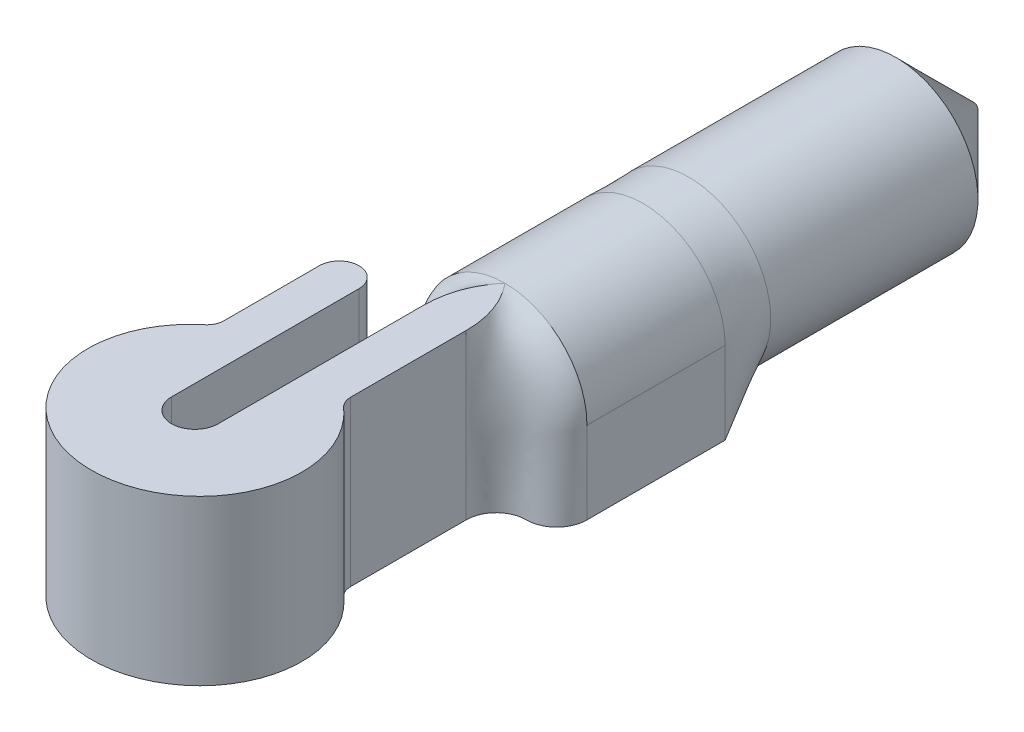
ISO-10303-21;
HEADER;
FILE_DESCRIPTION(('STEP AP214'),'2;1');
FILE_NAME('part.step','',(''),(''),'','','');
FILE_SCHEMA(('AUTOMOTIVE_DESIGN { 1 0 10303 214 1 1 1 1 }'));
ENDSEC;
DATA;
#1=APPLICATION_CONTEXT('core data for automotive mechanical design processes');
#2=APPLICATION_PROTOCOL_DEFINITION('international standard','automotive_design',2000,#1);
#3=PRODUCT_CONTEXT('',#1,'mechanical');
#4=PRODUCT('Part','Part','',(#3));
#5=PRODUCT_RELATED_PRODUCT_CATEGORY('part','',(#4));
#6=PRODUCT_DEFINITION_FORMATION('','',#4);
#7=PRODUCT_DEFINITION_CONTEXT('part definition',#1,'design');
#8=PRODUCT_DEFINITION('design','',#6,#7);
#9=PRODUCT_DEFINITION_SHAPE('','',#8);
#10=(LENGTH_UNIT() NAMED_UNIT(*) SI_UNIT(.MILLI.,.METRE.));
#11=(NAMED_UNIT(*) PLANE_ANGLE_UNIT() SI_UNIT($,.RADIAN.));
#12=(NAMED_UNIT(*) SI_UNIT($,.STERADIAN.) SOLID_ANGLE_UNIT());
#13=UNCERTAINTY_MEASURE_WITH_UNIT(LENGTH_MEASURE(1.E-05),#10,'distance_accuracy_value','');
#14=(GEOMETRIC_REPRESENTATION_CONTEXT(3) GLOBAL_UNCERTAINTY_ASSIGNED_CONTEXT((#13)) GLOBAL_UNIT_ASSIGNED_CONTEXT((#10,
#11,#12)) REPRESENTATION_CONTEXT('',''));
#15=CARTESIAN_POINT('',(0.,0.,0.));
#16=DIRECTION('',(0.,0.,1.));
#17=DIRECTION('',(1.,0.,0.));
#18=AXIS2_PLACEMENT_3D('',#15,#16,#17);
#19=CARTESIAN_POINT('',(1.3,2.375,-19.));
#20=DIRECTION('',(0.,0.,1.));
#21=DIRECTION('',(1.,0.,0.));
#22=AXIS2_PLACEMENT_3D('',#19,#20,#21);
#23=CYLINDRICAL_SURFACE('',#22,2.375);
#24=CARTESIAN_POINT('',(1.3,2.375,-19.));
#25=DIRECTION('',(0.,0.,-1.));
#26=DIRECTION('',(-1.,0.,0.));
#27=AXIS2_PLACEMENT_3D('',#24,#25,#26);
#28=CIRCLE('',#27,2.375);
#29=CARTESIAN_POINT('',(-1.075,2.375,-19.));
#30=VERTEX_POINT('',#29);
#31=EDGE_CURVE('E882',#30,#30,#28,.T.);
#32=ORIENTED_EDGE('',*,*,#31,.F.);
#33=EDGE_LOOP('',(#32));
#34=FACE_BOUND('',#33,.T.);
#35=CARTESIAN_POINT('',(-0.713995972012084,1.11625251749245,-13.));
#36=CARTESIAN_POINT('',(-0.60550803809779,0.942671823229577,-13.));
#37=CARTESIAN_POINT('',(-0.346326546498124,0.629631592535442,-13.));
#38=CARTESIAN_POINT('',(0.294663896422089,0.158196420254061,-13.));
#39=CARTESIAN_POINT('',(1.29986396853161,-0.106222952831294,-13.));
#40=CARTESIAN_POINT('',(2.30560098822545,0.158266036395828,-13.));
#41=CARTESIAN_POINT('',(2.94627731964234,0.629643292513034,-13.));
#42=CARTESIAN_POINT('',(3.20550803809779,0.942671823229577,-13.));
#43=CARTESIAN_POINT('',(3.31399597201208,1.11625251749245,-13.));
#44=B_SPLINE_CURVE_WITH_KNOTS('',3,(#35,#36,#37,#38,#39,#40,#41,#42,#43),.UNSPECIFIED.,.F.,.F.,
(4,1,1,1,1,1,4),(0.,0.125,0.25,0.5,0.75,0.875,1.),.UNSPECIFIED.);
#45=CARTESIAN_POINT('',(-0.714181385569733,1.11613697199891,-13.));
#46=VERTEX_POINT('',#45);
#47=CARTESIAN_POINT('',(3.31417166163639,1.11614325527003,-13.));
#48=VERTEX_POINT('',#47);
#49=EDGE_CURVE('E13',#46,#48,#44,.T.);
#50=ORIENTED_EDGE('',*,*,#49,.F.);
#51=CARTESIAN_POINT('',(1.3,2.375,-13.));
#52=DIRECTION('',(0.,0.,1.));
#53=DIRECTION('',(1.,0.,0.));
#54=AXIS2_PLACEMENT_3D('',#51,#52,#53);
#55=CIRCLE('',#54,2.375);
#56=EDGE_CURVE('E178',#48,#46,#55,.T.);
#57=ORIENTED_EDGE('',*,*,#56,.F.);
#58=EDGE_LOOP('',(#50,#57));
#59=FACE_BOUND('',#58,.T.);
#60=ADVANCED_FACE('F167',(#34,#59),#23,.T.);
#61=CARTESIAN_POINT('',(3.675,0.,-11.6780191334391));
#62=CARTESIAN_POINT('',(3.31399597201208,1.11625251749245,-13.));
#63=CARTESIAN_POINT('',(3.47708333333333,0.,-11.6780191334391));
#64=CARTESIAN_POINT('',(3.20550803809779,0.942671823229577,-13.));
#65=CARTESIAN_POINT('',(3.08125,0.,-11.6780191334392));
#66=CARTESIAN_POINT('',(2.94627731964234,0.629643292513034,-13.));
#67=CARTESIAN_POINT('',(2.28958333333334,0.,-11.6780191334392));
#68=CARTESIAN_POINT('',(2.30560098822545,0.158266036395828,-13.));
#69=CARTESIAN_POINT('',(1.3,0.,-11.6780191334391));
#70=CARTESIAN_POINT('',(1.29986396853161,-0.106222952831294,-13.));
#71=CARTESIAN_POINT('',(0.310416666666667,0.,-11.6780191334392));
#72=CARTESIAN_POINT('',(0.294663896422089,0.158196420254061,-13.));
#73=CARTESIAN_POINT('',(-0.48125,0.,-11.6780191334392));
#74=CARTESIAN_POINT('',(-0.346326546498124,0.629631592535442,-13.));
#75=CARTESIAN_POINT('',(-0.877083333333333,0.,-11.6780191334391));
#76=CARTESIAN_POINT('',(-0.60550803809779,0.942671823229577,-13.));
#77=CARTESIAN_POINT('',(-1.075,0.,-11.6780191334391));
#78=CARTESIAN_POINT('',(-0.713995972012084,1.11625251749245,-13.));
#79=B_SPLINE_SURFACE_WITH_KNOTS('',3,1,((#61,#62),(#63,#64),(#65,#66),(#67,#68),(#69,#70),(#71,
#72),(#73,#74),(#75,#76),(#77,#78)),.UNSPECIFIED.,.F.,.F.,.F.,(4,1,1,1,1,1,4),(2,2),(0.,0.125,
0.25,0.5,0.75,0.875,1.),(0.,1.),.UNSPECIFIED.);
#80=DIRECTION('',(1.,0.,0.));
#81=VECTOR('',#80,1.);
#82=CARTESIAN_POINT('',(3.675,0.,-11.6780191334391));
#83=LINE('',#82,#81);
#84=CARTESIAN_POINT('',(-1.075,0.,-11.6780191334391));
#85=VERTEX_POINT('',#84);
#86=CARTESIAN_POINT('',(3.675,0.,-11.6780191334391));
#87=VERTEX_POINT('',#86);
#88=EDGE_CURVE('E171',#85,#87,#83,.T.);
#89=DIRECTION('',(0.204248150970069,0.631551160202425,-0.74794774207312));
#90=VECTOR('',#89,1.);
#91=CARTESIAN_POINT('',(-0.894497986006042,0.558126258746224,-12.3390095667196));
#92=LINE('',#91,#90);
#93=EDGE_CURVE('E275',#85,#46,#92,.T.);
#94=DIRECTION('',(0.204248150970069,-0.631551160202425,0.74794774207312));
#95=VECTOR('',#94,1.);
#96=CARTESIAN_POINT('',(3.49449798600604,0.558126258746224,-12.3390095667196));
#97=LINE('',#96,#95);
#98=EDGE_CURVE('E286',#48,#87,#97,.T.);
#99=ORIENTED_EDGE('',*,*,#88,.F.);
#100=ORIENTED_EDGE('',*,*,#93,.T.);
#101=ORIENTED_EDGE('',*,*,#49,.T.);
#102=ORIENTED_EDGE('',*,*,#98,.T.);
#103=EDGE_LOOP('',(#99,#100,#101,#102));
#104=FACE_BOUND('',#103,.T.);
#105=ADVANCED_FACE('F292',(#104),#79,.T.);
#106=CARTESIAN_POINT('',(-1.075,0.,-11.6780191334391));
#107=CARTESIAN_POINT('',(-0.713995972012084,1.11625251749245,-13.));
#108=CARTESIAN_POINT('',(-1.075,0.197916666666667,-11.6780191334391));
#109=CARTESIAN_POINT('',(-0.810224067768728,1.27021747070308,-13.));
#110=CARTESIAN_POINT('',(-1.075,0.587757387922788,-11.6780191334391));
#111=CARTESIAN_POINT('',(-0.970298967263065,1.60581895112441,-13.));
#112=CARTESIAN_POINT('',(-1.075,1.16814642370217,-11.6780191334392));
#113=CARTESIAN_POINT('',(-1.0868390685559,2.15635912667143,-13.));
#114=CARTESIAN_POINT('',(-1.075,1.75674618093464,-11.6780191334391));
#115=CARTESIAN_POINT('',(-1.07216093712572,2.70834489752312,-13.));
#116=CARTESIAN_POINT('',(-1.075,2.16410786900154,-11.6780191334391));
#117=CARTESIAN_POINT('',(-0.983524387310852,3.04960459888077,-13.));
#118=CARTESIAN_POINT('',(-1.075,2.67939903841652,-11.6780191334391));
#119=CARTESIAN_POINT('',(-0.83755009514696,3.43886937798449,-13.));
#120=CARTESIAN_POINT('',(-0.956490562198617,3.29306959468298,-11.6780191334391));
#121=CARTESIAN_POINT('',(-0.594145096715219,3.86650032701684,-13.));
#122=CARTESIAN_POINT('',(-0.435168992337904,4.08662764047852,-11.6780191334392));
#123=CARTESIAN_POINT('',(-0.0626770280279037,4.36579823923451,-13.));
#124=CARTESIAN_POINT('',(0.357411512429113,4.62352484104911,-11.6780191334391));
#125=CARTESIAN_POINT('',(0.588687396920721,4.67761350696573,-13.));
#126=CARTESIAN_POINT('',(1.3,4.81338503000466,-11.6780191334392));
#127=CARTESIAN_POINT('',(1.3,4.78665047970972,-13.));
#128=CARTESIAN_POINT('',(2.24258848757089,4.6235248410491,-11.6780191334392));
#129=CARTESIAN_POINT('',(2.01131260307928,4.67761350696573,-13.));
#130=CARTESIAN_POINT('',(3.03516899233791,4.08662764047852,-11.6780191334391));
#131=CARTESIAN_POINT('',(2.6626770280279,4.36579823923452,-13.));
#132=CARTESIAN_POINT('',(3.55649056219862,3.29306959468298,-11.6780191334392));
#133=CARTESIAN_POINT('',(3.19414509671522,3.86650032701684,-13.));
#134=CARTESIAN_POINT('',(3.675,2.67939903841651,-11.6780191334391));
#135=CARTESIAN_POINT('',(3.43755009514696,3.43886937798449,-13.));
#136=CARTESIAN_POINT('',(3.675,2.16410786900154,-11.6780191334391));
#137=CARTESIAN_POINT('',(3.58352438731085,3.04960459888077,-13.));
#138=CARTESIAN_POINT('',(3.675,1.75674618093464,-11.6780191334392));
#139=CARTESIAN_POINT('',(3.67216093712571,2.70834489752312,-13.));
#140=CARTESIAN_POINT('',(3.675,1.16814642370217,-11.6780191334391));
#141=CARTESIAN_POINT('',(3.68683906855591,2.15635912667142,-13.));
#142=CARTESIAN_POINT('',(3.675,0.587757387922788,-11.6780191334392));
#143=CARTESIAN_POINT('',(3.57029896726306,1.60581895112441,-13.));
#144=CARTESIAN_POINT('',(3.675,0.197916666666667,-11.6780191334391));
#145=CARTESIAN_POINT('',(3.41022406776873,1.27021747070308,-13.));
#146=CARTESIAN_POINT('',(3.675,0.,-11.6780191334391));
#147=CARTESIAN_POINT('',(3.31399597201208,1.11625251749245,-13.));
#148=B_SPLINE_SURFACE_WITH_KNOTS('',3,1,((#106,#107),(#108,#109),(#110,#111),(#112,#113),(#114,
#115),(#116,#117),(#118,#119),(#120,#121),(#122,#123),(#124,#125),(#126,#127),(#128,#129),(#130,
#131),(#132,#133),(#134,#135),(#136,#137),(#138,#139),(#140,#141),(#142,#143),(#144,#145),(#146,
#147)),.UNSPECIFIED.,.F.,.F.,.F.,(4,1,1,1,2,1,1,1,1,1,1,1,2,1,1,1,4),(2,2),(0.,
0.0511584863378663,0.102316972675733,0.153475459013599,0.204633945351465,0.278475459013599,
0.352316972675733,0.426158486337866,0.5,0.573841513662134,0.647683027324267,0.721524540986401,
0.795366054648535,0.846524540986401,0.897683027324267,0.948841513662134,1.),(0.,1.),.UNSPECIFIED.);
#149=DIRECTION('',(0.,-1.,0.));
#150=VECTOR('',#149,1.);
#151=CARTESIAN_POINT('',(-1.075,0.,-11.6780191334391));
#152=LINE('',#151,#150);
#153=CARTESIAN_POINT('',(-1.075,2.375,-11.6780191334391));
#154=VERTEX_POINT('',#153);
#155=EDGE_CURVE('E279',#154,#85,#152,.T.);
#156=CARTESIAN_POINT('',(1.3,2.375,-11.6780191334391));
#157=DIRECTION('',(0.,0.,1.));
#158=DIRECTION('',(-1.,0.,0.));
#159=AXIS2_PLACEMENT_3D('',#156,#157,#158);
#160=CIRCLE('',#159,2.375);
#161=CARTESIAN_POINT('',(3.675,2.37500000000142,-11.6780191334392));
#162=VERTEX_POINT('',#161);
#163=EDGE_CURVE('E320',#162,#154,#160,.T.);
#164=DIRECTION('',(0.,1.,0.));
#165=VECTOR('',#164,1.);
#166=CARTESIAN_POINT('',(3.675,0.,-11.6780191334391));
#167=LINE('',#166,#165);
#168=EDGE_CURVE('E297',#87,#162,#167,.T.);
#169=ORIENTED_EDGE('',*,*,#155,.F.);
#170=ORIENTED_EDGE('',*,*,#163,.F.);
#171=ORIENTED_EDGE('',*,*,#168,.F.);
#172=ORIENTED_EDGE('',*,*,#98,.F.);
#173=ORIENTED_EDGE('',*,*,#56,.T.);
#174=ORIENTED_EDGE('',*,*,#93,.F.);
#175=EDGE_LOOP('',(#169,#170,#171,#172,#173,#174));
#176=FACE_BOUND('',#175,.T.);
#177=ADVANCED_FACE('F277',(#176),#148,.T.);
#178=CARTESIAN_POINT('',(-1.25,4.75,-5.42801913343913));
#179=DIRECTION('',(0.,-1.,0.));
#180=DIRECTION('',(0.,0.,-1.));
#181=AXIS2_PLACEMENT_3D('',#178,#179,#180);
#182=CYLINDRICAL_SURFACE('',#181,0.575);
#183=CARTESIAN_POINT('',(-1.25,0.,-5.42801913343913));
#184=DIRECTION('',(0.,1.,0.));
#185=DIRECTION('',(0.,0.,1.));
#186=AXIS2_PLACEMENT_3D('',#183,#184,#185);
#187=CIRCLE('',#186,0.575);
#188=CARTESIAN_POINT('',(-0.675,0.,-5.42801913343913));
#189=VERTEX_POINT('',#188);
#190=CARTESIAN_POINT('',(-1.825,0.,-5.42801913343913));
#191=VERTEX_POINT('',#190);
#192=EDGE_CURVE('E361',#189,#191,#187,.T.);
#193=ORIENTED_EDGE('',*,*,#192,.T.);
#194=DIRECTION('',(0.,-1.,0.));
#195=VECTOR('',#194,1.);
#196=CARTESIAN_POINT('',(-1.825,4.75,-5.42801913343913));
#197=LINE('',#196,#195);
#198=CARTESIAN_POINT('',(-1.825,4.75,-5.42801913343913));
#199=VERTEX_POINT('',#198);
#200=EDGE_CURVE('E727',#199,#191,#197,.T.);
#201=ORIENTED_EDGE('',*,*,#200,.F.);
#202=CARTESIAN_POINT('',(-1.25,4.75,-5.42801913343913));
#203=DIRECTION('',(0.,1.,0.));
#204=DIRECTION('',(0.,0.,1.));
#205=AXIS2_PLACEMENT_3D('',#202,#203,#204);
#206=CIRCLE('',#205,0.575);
#207=CARTESIAN_POINT('',(-0.675,4.75,-5.42801913343913));
#208=VERTEX_POINT('',#207);
#209=EDGE_CURVE('E759',#208,#199,#206,.T.);
#210=ORIENTED_EDGE('',*,*,#209,.F.);
#211=DIRECTION('',(0.,-1.,0.));
#212=VECTOR('',#211,1.);
#213=CARTESIAN_POINT('',(-0.675,4.75,-5.42801913343913));
#214=LINE('',#213,#212);
#215=EDGE_CURVE('E298',#208,#189,#214,.T.);
#216=ORIENTED_EDGE('',*,*,#215,.T.);
#217=EDGE_LOOP('',(#193,#201,#210,#216));
#218=FACE_BOUND('',#217,.T.);
#219=ADVANCED_FACE('F541',(#218),#182,.T.);
#220=CARTESIAN_POINT('',(-1.825,4.75,-5.42801913343913));
#221=DIRECTION('',(1.,0.,0.));
#222=DIRECTION('',(0.,0.,-1.));
#223=AXIS2_PLACEMENT_3D('',#220,#221,#222);
#224=PLANE('',#223);
#225=DIRECTION('',(0.,0.,1.));
#226=VECTOR('',#225,1.);
#227=CARTESIAN_POINT('',(-1.825,0.,-5.42801913343913));
#228=LINE('',#227,#226);
#229=CARTESIAN_POINT('',(-1.825,0.,-2.67224685078573));
#230=VERTEX_POINT('',#229);
#231=EDGE_CURVE('E687',#191,#230,#228,.T.);
#232=ORIENTED_EDGE('',*,*,#231,.T.);
#233=DIRECTION('',(0.,-1.,0.));
#234=VECTOR('',#233,1.);
#235=CARTESIAN_POINT('',(-1.825,4.75,-2.67224685078573));
#236=LINE('',#235,#234);
#237=CARTESIAN_POINT('',(-1.825,4.75,-2.67224685078573));
#238=VERTEX_POINT('',#237);
#239=EDGE_CURVE('E723',#238,#230,#236,.T.);
#240=ORIENTED_EDGE('',*,*,#239,.F.);
#241=DIRECTION('',(0.,0.,1.));
#242=VECTOR('',#241,1.);
#243=CARTESIAN_POINT('',(-1.825,4.75,-5.42801913343913));
#244=LINE('',#243,#242);
#245=EDGE_CURVE('E753',#199,#238,#244,.T.);
#246=ORIENTED_EDGE('',*,*,#245,.F.);
#247=ORIENTED_EDGE('',*,*,#200,.T.);
#248=EDGE_LOOP('',(#232,#240,#246,#247));
#249=FACE_BOUND('',#248,.T.);
#250=ADVANCED_FACE('F752',(#249),#224,.F.);
#251=CARTESIAN_POINT('',(-2.325,4.75,-2.67224685078573));
#252=DIRECTION('',(0.,-1.,0.));
#253=DIRECTION('',(0.,0.,-1.));
#254=AXIS2_PLACEMENT_3D('',#251,#252,#253);
#255=CYLINDRICAL_SURFACE('',#254,0.5);
#256=CARTESIAN_POINT('',(-2.325,0.,-2.67224685078573));
#257=DIRECTION('',(0.,-1.,0.));
#258=DIRECTION('',(0.,0.,1.));
#259=AXIS2_PLACEMENT_3D('',#256,#257,#258);
#260=CIRCLE('',#259,0.5);
#261=CARTESIAN_POINT('',(-2.00741301696706,0.,-2.28606229877977));
#262=VERTEX_POINT('',#261);
#263=EDGE_CURVE('E690',#230,#262,#260,.T.);
#264=ORIENTED_EDGE('',*,*,#263,.T.);
#265=DIRECTION('',(0.,-1.,0.));
#266=VECTOR('',#265,1.);
#267=CARTESIAN_POINT('',(-2.00741301696706,4.75,-2.28606229877977));
#268=LINE('',#267,#266);
#269=CARTESIAN_POINT('',(-2.00741301696706,4.75,-2.28606229877977));
#270=VERTEX_POINT('',#269);
#271=EDGE_CURVE('E719',#270,#262,#268,.T.);
#272=ORIENTED_EDGE('',*,*,#271,.F.);
#273=CARTESIAN_POINT('',(-2.325,4.75,-2.67224685078573));
#274=DIRECTION('',(0.,-1.,0.));
#275=DIRECTION('',(0.,0.,1.));
#276=AXIS2_PLACEMENT_3D('',#273,#274,#275);
#277=CIRCLE('',#276,0.5);
#278=EDGE_CURVE('E678',#238,#270,#277,.T.);
#279=ORIENTED_EDGE('',*,*,#278,.F.);
#280=ORIENTED_EDGE('',*,*,#239,.T.);
#281=EDGE_LOOP('',(#264,#272,#279,#280));
#282=FACE_BOUND('',#281,.T.);
#283=ADVANCED_FACE('F672',(#282),#255,.F.);
#284=CARTESIAN_POINT('',(0.,4.75,0.));
#285=DIRECTION('',(0.,1.,0.));
#286=DIRECTION('',(1.,0.,0.));
#287=AXIS2_PLACEMENT_3D('',#284,#285,#286);
#288=ELLIPSE('',#287,3.1,3.);
#289=DIRECTION('',(0.,-1.,0.));
#290=VECTOR('',#289,1.);
#291=SURFACE_OF_LINEAR_EXTRUSION('',#288,#290);
#292=CARTESIAN_POINT('',(0.,0.,0.));
#293=DIRECTION('',(0.,1.,0.));
#294=DIRECTION('',(1.,0.,0.));
#295=AXIS2_PLACEMENT_3D('',#292,#293,#294);
#296=ELLIPSE('',#295,3.1,3.);
#297=CARTESIAN_POINT('',(2.0934105931897,0.,-2.21264666985684));
#298=VERTEX_POINT('',#297);
#299=EDGE_CURVE('E693',#262,#298,#296,.T.);
#300=ORIENTED_EDGE('',*,*,#299,.T.);
#301=DIRECTION('',(0.,-1.,0.));
#302=VECTOR('',#301,1.);
#303=CARTESIAN_POINT('',(2.0934105931897,4.75,-2.21264666985684));
#304=LINE('',#303,#302);
#305=CARTESIAN_POINT('',(2.0934105931897,4.75,-2.21264666985684));
#306=VERTEX_POINT('',#305);
#307=EDGE_CURVE('E715',#306,#298,#304,.T.);
#308=ORIENTED_EDGE('',*,*,#307,.F.);
#309=EDGE_CURVE('E635',#270,#306,#288,.T.);
#310=ORIENTED_EDGE('',*,*,#309,.F.);
#311=ORIENTED_EDGE('',*,*,#271,.T.);
#312=EDGE_LOOP('',(#300,#308,#310,#311));
#313=FACE_BOUND('',#312,.T.);
#314=ADVANCED_FACE('F667',(#313),#291,.F.);
#315=CARTESIAN_POINT('',(2.425,4.75,-2.58687716739972));
#316=DIRECTION('',(0.,-1.,0.));
#317=DIRECTION('',(0.,0.,-1.));
#318=AXIS2_PLACEMENT_3D('',#315,#316,#317);
#319=CYLINDRICAL_SURFACE('',#318,0.5);
#320=CARTESIAN_POINT('',(2.425,0.,-2.58687716739972));
#321=DIRECTION('',(0.,-1.,0.));
#322=DIRECTION('',(0.,0.,-1.));
#323=AXIS2_PLACEMENT_3D('',#320,#321,#322);
#324=CIRCLE('',#323,0.5);
#325=CARTESIAN_POINT('',(1.925,0.,-2.58687716739972));
#326=VERTEX_POINT('',#325);
#327=EDGE_CURVE('E696',#298,#326,#324,.T.);
#328=ORIENTED_EDGE('',*,*,#327,.T.);
#329=DIRECTION('',(0.,-1.,0.));
#330=VECTOR('',#329,1.);
#331=CARTESIAN_POINT('',(1.925,4.75,-2.58687716739972));
#332=LINE('',#331,#330);
#333=CARTESIAN_POINT('',(1.925,4.75,-2.58687716739972));
#334=VERTEX_POINT('',#333);
#335=EDGE_CURVE('E455',#334,#326,#332,.T.);
#336=ORIENTED_EDGE('',*,*,#335,.F.);
#337=CARTESIAN_POINT('',(2.425,4.75,-2.58687716739972));
#338=DIRECTION('',(0.,-1.,0.));
#339=DIRECTION('',(0.,0.,-1.));
#340=AXIS2_PLACEMENT_3D('',#337,#338,#339);
#341=CIRCLE('',#340,0.5);
#342=EDGE_CURVE('E625',#306,#334,#341,.T.);
#343=ORIENTED_EDGE('',*,*,#342,.F.);
#344=ORIENTED_EDGE('',*,*,#307,.T.);
#345=EDGE_LOOP('',(#328,#336,#343,#344));
#346=FACE_BOUND('',#345,.T.);
#347=ADVANCED_FACE('F664',(#346),#319,.F.);
#348=CARTESIAN_POINT('',(1.925,4.75,-5.92801913343913));
#349=DIRECTION('',(-1.,0.,0.));
#350=DIRECTION('',(0.,0.,1.));
#351=AXIS2_PLACEMENT_3D('',#348,#349,#350);
#352=PLANE('',#351);
#353=DIRECTION('',(0.,0.,-1.));
#354=VECTOR('',#353,1.);
#355=CARTESIAN_POINT('',(1.925,0.,-5.92801913343913));
#356=LINE('',#355,#354);
#357=CARTESIAN_POINT('',(1.925,0.,-5.92801913343913));
#358=VERTEX_POINT('',#357);
#359=EDGE_CURVE('E460',#326,#358,#356,.T.);
#360=ORIENTED_EDGE('',*,*,#359,.T.);
#361=CARTESIAN_POINT('',(1.925,4.75,-5.92801913343913));
#362=CARTESIAN_POINT('',(1.925,4.51336985224696,-5.92801913343913));
#363=CARTESIAN_POINT('',(1.925,4.04745612850482,-5.92801913343914));
#364=CARTESIAN_POINT('',(1.925,3.3587572106361,-5.92801913343912));
#365=CARTESIAN_POINT('',(1.925,2.67005829276738,-5.92801913343913));
#366=CARTESIAN_POINT('',(1.925,2.20414456902524,-5.92801913343913));
#367=CARTESIAN_POINT('',(1.925,1.80831123569191,-5.92801913343913));
#368=CARTESIAN_POINT('',(1.925,1.48308616906621,-5.92801913343913));
#369=CARTESIAN_POINT('',(1.925,0.9837572106361,-5.92801913343913));
#370=CARTESIAN_POINT('',(1.925,0.48442825220599,-5.92801913343913));
#371=CARTESIAN_POINT('',(1.925,0.159203185580293,-5.92801913343913));
#372=CARTESIAN_POINT('',(1.925,0.,-5.92801913343913));
#373=B_SPLINE_CURVE_WITH_KNOTS('',3,(#361,#362,#363,#364,#365,#366,#367,#368,#369,#370,#371,
#372),.UNSPECIFIED.,.F.,.F.,(4,1,1,1,2,1,1,1,4),(0.,0.149450619633499,0.298901239266998,
0.448351858900497,0.597802478533996,0.698351858900497,0.798901239266998,0.899450619633499,1.),.UNSPECIFIED.);
#374=CARTESIAN_POINT('',(1.925,4.75,-5.92801913343913));
#375=VERTEX_POINT('',#374);
#376=EDGE_CURVE('E447',#375,#358,#373,.T.);
#377=ORIENTED_EDGE('',*,*,#376,.F.);
#378=DIRECTION('',(0.,0.,-1.));
#379=VECTOR('',#378,1.);
#380=CARTESIAN_POINT('',(1.925,4.75,-5.92801913343913));
#381=LINE('',#380,#379);
#382=EDGE_CURVE('E623',#334,#375,#381,.T.);
#383=ORIENTED_EDGE('',*,*,#382,.F.);
#384=ORIENTED_EDGE('',*,*,#335,.T.);
#385=EDGE_LOOP('',(#360,#377,#383,#384));
#386=FACE_BOUND('',#385,.T.);
#387=ADVANCED_FACE('F660',(#386),#352,.F.);
#388=CARTESIAN_POINT('',(0.674999999999999,4.75,-2.92801913343913));
#389=DIRECTION('',(1.,0.,0.));
#390=DIRECTION('',(0.,0.,-1.));
#391=AXIS2_PLACEMENT_3D('',#388,#389,#390);
#392=PLANE('',#391);
#393=DIRECTION('',(0.,0.,1.));
#394=VECTOR('',#393,1.);
#395=CARTESIAN_POINT('',(0.674999999999999,0.,-2.92801913343913));
#396=LINE('',#395,#394);
#397=CARTESIAN_POINT('',(0.674999999999999,0.,-5.92801913343913));
#398=VERTEX_POINT('',#397);
#399=CARTESIAN_POINT('',(0.675,0.,0.));
#400=VERTEX_POINT('',#399);
#401=EDGE_CURVE('E703',#398,#400,#396,.T.);
#402=ORIENTED_EDGE('',*,*,#401,.T.);
#403=DIRECTION('',(0.,-1.,0.));
#404=VECTOR('',#403,1.);
#405=CARTESIAN_POINT('',(0.675,4.75,0.));
#406=LINE('',#405,#404);
#407=CARTESIAN_POINT('',(0.675,4.75,0.));
#408=VERTEX_POINT('',#407);
#409=EDGE_CURVE('E709',#408,#400,#406,.T.);
#410=ORIENTED_EDGE('',*,*,#409,.F.);
#411=DIRECTION('',(0.,0.,1.));
#412=VECTOR('',#411,1.);
#413=CARTESIAN_POINT('',(0.674999999999999,4.75,-2.92801913343913));
#414=LINE('',#413,#412);
#415=CARTESIAN_POINT('',(0.674999999999999,4.75,-5.92801913343913));
#416=VERTEX_POINT('',#415);
#417=EDGE_CURVE('E629',#416,#408,#414,.T.);
#418=ORIENTED_EDGE('',*,*,#417,.F.);
#419=CARTESIAN_POINT('',(0.674999999999999,0.,-5.92801913343913));
#420=CARTESIAN_POINT('',(0.674999999999999,0.159203185580293,-5.92801913343913));
#421=CARTESIAN_POINT('',(0.675,0.484428252205989,-5.92801913343914));
#422=CARTESIAN_POINT('',(0.674999999999999,0.983757210636102,-5.92801913343912));
#423=CARTESIAN_POINT('',(0.674999999999999,1.48308616906621,-5.92801913343914));
#424=CARTESIAN_POINT('',(0.674999999999999,1.80831123569191,-5.92801913343913));
#425=CARTESIAN_POINT('',(0.674999999999999,2.20414456902524,-5.92801913343913));
#426=CARTESIAN_POINT('',(0.675,2.67005829276738,-5.92801913343913));
#427=CARTESIAN_POINT('',(0.674999999999998,3.3587572106361,-5.92801913343913));
#428=CARTESIAN_POINT('',(0.675,4.04745612850482,-5.92801913343913));
#429=CARTESIAN_POINT('',(0.674999999999999,4.51336985224696,-5.92801913343913));
#430=CARTESIAN_POINT('',(0.674999999999999,4.75,-5.92801913343913));
#431=B_SPLINE_CURVE_WITH_KNOTS('',3,(#419,#420,#421,#422,#423,#424,#425,#426,#427,#428,#429,
#430),.UNSPECIFIED.,.F.,.F.,(4,1,1,1,2,1,1,1,4),(0.,0.100549380366501,0.201098760733002,
0.301648141099503,0.402197521466004,0.551648141099503,0.701098760733002,0.850549380366501,1.),.UNSPECIFIED.);
#432=EDGE_CURVE('E456',#416,#398,#431,.F.);
#433=ORIENTED_EDGE('',*,*,#432,.T.);
#434=EDGE_LOOP('',(#402,#410,#418,#433));
#435=FACE_BOUND('',#434,.T.);
#436=ADVANCED_FACE('F651',(#435),#392,.F.);
#437=CARTESIAN_POINT('',(0.,4.75,0.));
#438=DIRECTION('',(0.,-1.,0.));
#439=DIRECTION('',(0.,0.,-1.));
#440=AXIS2_PLACEMENT_3D('',#437,#438,#439);
#441=CYLINDRICAL_SURFACE('',#440,0.675);
#442=CARTESIAN_POINT('',(0.,0.,0.));
#443=DIRECTION('',(0.,-1.,0.));
#444=DIRECTION('',(0.,0.,1.));
#445=AXIS2_PLACEMENT_3D('',#442,#443,#444);
#446=CIRCLE('',#445,0.675);
#447=CARTESIAN_POINT('',(-0.675,0.,0.));
#448=VERTEX_POINT('',#447);
#449=EDGE_CURVE('E699',#400,#448,#446,.T.);
#450=ORIENTED_EDGE('',*,*,#449,.T.);
#451=DIRECTION('',(0.,-1.,0.));
#452=VECTOR('',#451,1.);
#453=CARTESIAN_POINT('',(-0.675,4.75,0.));
#454=LINE('',#453,#452);
#455=CARTESIAN_POINT('',(-0.675,4.75,0.));
#456=VERTEX_POINT('',#455);
#457=EDGE_CURVE('E684',#456,#448,#454,.T.);
#458=ORIENTED_EDGE('',*,*,#457,.F.);
#459=CARTESIAN_POINT('',(0.,4.75,0.));
#460=DIRECTION('',(0.,-1.,0.));
#461=DIRECTION('',(0.,0.,1.));
#462=AXIS2_PLACEMENT_3D('',#459,#460,#461);
#463=CIRCLE('',#462,0.675);
#464=EDGE_CURVE('E633',#408,#456,#463,.T.);
#465=ORIENTED_EDGE('',*,*,#464,.F.);
#466=ORIENTED_EDGE('',*,*,#409,.T.);
#467=EDGE_LOOP('',(#450,#458,#465,#466));
#468=FACE_BOUND('',#467,.T.);
#469=ADVANCED_FACE('F659',(#468),#441,.F.);
#470=CARTESIAN_POINT('',(-0.675,4.75,-2.92801913343913));
#471=DIRECTION('',(-1.,0.,0.));
#472=DIRECTION('',(0.,0.,1.));
#473=AXIS2_PLACEMENT_3D('',#470,#471,#472);
#474=PLANE('',#473);
#475=DIRECTION('',(0.,0.,-1.));
#476=VECTOR('',#475,1.);
#477=CARTESIAN_POINT('',(-0.675,0.,-2.92801913343913));
#478=LINE('',#477,#476);
#479=EDGE_CURVE('E702',#448,#189,#478,.T.);
#480=ORIENTED_EDGE('',*,*,#479,.T.);
#481=ORIENTED_EDGE('',*,*,#215,.F.);
#482=DIRECTION('',(0.,0.,-1.));
#483=VECTOR('',#482,1.);
#484=CARTESIAN_POINT('',(-0.675,4.75,-2.92801913343913));
#485=LINE('',#484,#483);
#486=EDGE_CURVE('E372',#456,#208,#485,.T.);
#487=ORIENTED_EDGE('',*,*,#486,.F.);
#488=ORIENTED_EDGE('',*,*,#457,.T.);
#489=EDGE_LOOP('',(#480,#481,#487,#488));
#490=FACE_BOUND('',#489,.T.);
#491=ADVANCED_FACE('F484',(#490),#474,.F.);
#492=CARTESIAN_POINT('',(0.,4.75,0.));
#493=DIRECTION('',(0.,1.,0.));
#494=DIRECTION('',(0.,0.,1.));
#495=AXIS2_PLACEMENT_3D('',#492,#493,#494);
#496=PLANE('',#495);
#497=ORIENTED_EDGE('',*,*,#486,.T.);
#498=ORIENTED_EDGE('',*,*,#209,.T.);
#499=ORIENTED_EDGE('',*,*,#245,.T.);
#500=ORIENTED_EDGE('',*,*,#278,.T.);
#501=ORIENTED_EDGE('',*,*,#309,.T.);
#502=ORIENTED_EDGE('',*,*,#342,.T.);
#503=ORIENTED_EDGE('',*,*,#382,.T.);
#504=CARTESIAN_POINT('',(1.925,4.75,-5.92801913343913));
#505=CARTESIAN_POINT('',(1.925,4.75,-6.26135246677246));
#506=CARTESIAN_POINT('',(1.87291666666667,4.75,-6.57385246677247));
#507=CARTESIAN_POINT('',(1.66458333333333,4.75,-7.15718580010579));
#508=CARTESIAN_POINT('',(1.50833333333333,4.75,-7.42801913343914));
#509=CARTESIAN_POINT('',(1.3,4.75,-7.67801913343915));
#510=B_SPLINE_CURVE_WITH_KNOTS('',3,(#504,#505,#506,#507,#508,#509),.UNSPECIFIED.,.F.,.F.,(4,2,
4),(0.,0.499999999999998,1.),.UNSPECIFIED.);
#511=CARTESIAN_POINT('',(1.3,4.75,-7.67801913343915));
#512=VERTEX_POINT('',#511);
#513=EDGE_CURVE('E380',#375,#512,#510,.T.);
#514=ORIENTED_EDGE('',*,*,#513,.T.);
#515=CARTESIAN_POINT('',(0.674999999999999,4.75,-5.92801913343913));
#516=CARTESIAN_POINT('',(0.674999999999999,4.75,-6.26135246677246));
#517=CARTESIAN_POINT('',(0.727083333333331,4.75,-6.57385246677247));
#518=CARTESIAN_POINT('',(0.935416666666666,4.75,-7.15718580010579));
#519=CARTESIAN_POINT('',(1.09166666666667,4.75,-7.42801913343914));
#520=CARTESIAN_POINT('',(1.3,4.75,-7.67801913343915));
#521=B_SPLINE_CURVE_WITH_KNOTS('',3,(#515,#516,#517,#518,#519,#520),.UNSPECIFIED.,.F.,.F.,(4,2,
4),(0.,0.499999999999998,1.),.UNSPECIFIED.);
#522=EDGE_CURVE('E409',#416,#512,#521,.T.);
#523=ORIENTED_EDGE('',*,*,#522,.F.);
#524=ORIENTED_EDGE('',*,*,#417,.T.);
#525=ORIENTED_EDGE('',*,*,#464,.T.);
#526=EDGE_LOOP('',(#497,#498,#499,#500,#501,#502,#503,#514,#523,#524,#525));
#527=FACE_BOUND('',#526,.T.);
#528=ADVANCED_FACE('F482',(#527),#496,.T.);
#529=CARTESIAN_POINT('',(0.,0.,0.));
#530=DIRECTION('',(0.,1.,0.));
#531=DIRECTION('',(0.,0.,1.));
#532=AXIS2_PLACEMENT_3D('',#529,#530,#531);
#533=PLANE('',#532);
#534=ORIENTED_EDGE('',*,*,#192,.F.);
#535=ORIENTED_EDGE('',*,*,#479,.F.);
#536=ORIENTED_EDGE('',*,*,#449,.F.);
#537=ORIENTED_EDGE('',*,*,#401,.F.);
#538=CARTESIAN_POINT('',(0.674999999999999,0.,-5.92801913343913));
#539=CARTESIAN_POINT('',(0.675000000000002,0.,-6.41094476712185));
#540=CARTESIAN_POINT('',(0.282925633682723,0.,-6.80301913343913));
#541=CARTESIAN_POINT('',(-0.682925633682717,0.,-6.80301913343915));
#542=CARTESIAN_POINT('',(-1.07499999999999,0.,-7.19509349975643));
#543=CARTESIAN_POINT('',(-1.075,0.,-7.67801913343915));
#544=B_SPLINE_CURVE_WITH_KNOTS('',3,(#538,#539,#540,#541,#542,#543),.UNSPECIFIED.,.F.,.F.,(4,2,
4),(0.,0.499999999999998,1.),.UNSPECIFIED.);
#545=CARTESIAN_POINT('',(-1.075,0.,-7.67801913343915));
#546=VERTEX_POINT('',#545);
#547=EDGE_CURVE('E307',#398,#546,#544,.T.);
#548=ORIENTED_EDGE('',*,*,#547,.T.);
#549=DIRECTION('',(0.,0.,1.));
#550=VECTOR('',#549,1.);
#551=CARTESIAN_POINT('',(-1.075,0.,-11.6780191334391));
#552=LINE('',#551,#550);
#553=EDGE_CURVE('E302',#85,#546,#552,.T.);
#554=ORIENTED_EDGE('',*,*,#553,.F.);
#555=ORIENTED_EDGE('',*,*,#88,.T.);
#556=DIRECTION('',(0.,0.,1.));
#557=VECTOR('',#556,1.);
#558=CARTESIAN_POINT('',(3.675,0.,-11.6780191334391));
#559=LINE('',#558,#557);
#560=CARTESIAN_POINT('',(3.675,0.,-7.67801913343915));
#561=VERTEX_POINT('',#560);
#562=EDGE_CURVE('E461',#87,#561,#559,.T.);
#563=ORIENTED_EDGE('',*,*,#562,.T.);
#564=CARTESIAN_POINT('',(1.925,0.,-5.92801913343913));
#565=CARTESIAN_POINT('',(1.925,0.,-6.41094476712185));
#566=CARTESIAN_POINT('',(2.31707436631728,0.,-6.80301913343913));
#567=CARTESIAN_POINT('',(3.28292563368271,0.,-6.80301913343915));
#568=CARTESIAN_POINT('',(3.675,0.,-7.19509349975643));
#569=CARTESIAN_POINT('',(3.675,0.,-7.67801913343915));
#570=B_SPLINE_CURVE_WITH_KNOTS('',3,(#564,#565,#566,#567,#568,#569),.UNSPECIFIED.,.F.,.F.,(4,2,
4),(0.,0.499999999999998,1.),.UNSPECIFIED.);
#571=EDGE_CURVE('E313',#561,#358,#570,.F.);
#572=ORIENTED_EDGE('',*,*,#571,.T.);
#573=ORIENTED_EDGE('',*,*,#359,.F.);
#574=ORIENTED_EDGE('',*,*,#327,.F.);
#575=ORIENTED_EDGE('',*,*,#299,.F.);
#576=ORIENTED_EDGE('',*,*,#263,.F.);
#577=ORIENTED_EDGE('',*,*,#231,.F.);
#578=EDGE_LOOP('',(#534,#535,#536,#537,#548,#554,#555,#563,#572,#573,#574,#575,#576,#577));
#579=FACE_BOUND('',#578,.T.);
#580=ADVANCED_FACE('F304',(#579),#533,.F.);
#581=CARTESIAN_POINT('',(0.674999999999999,0.,-5.92801913343913));
#582=CARTESIAN_POINT('',(0.675000000000002,0.,-6.41094476712185));
#583=CARTESIAN_POINT('',(0.282925633682723,0.,-6.80301913343913));
#584=CARTESIAN_POINT('',(-0.682925633682717,0.,-6.80301913343915));
#585=CARTESIAN_POINT('',(-1.07499999999999,0.,-7.19509349975643));
#586=CARTESIAN_POINT('',(-1.075,0.,-7.67801913343915));
#587=CARTESIAN_POINT('',(0.674999999999999,0.159203185580293,-5.92801913343913));
#588=CARTESIAN_POINT('',(0.661733067868311,0.1667759017089,-6.40593096275261));
#589=CARTESIAN_POINT('',(0.271278363247634,0.174348617837506,-6.79533827799447));
#590=CARTESIAN_POINT('',(-0.681752257035805,0.189494050094719,-6.81488954639909));
#591=CARTESIAN_POINT('',(-1.06871566372709,0.197066766223325,-7.20290034246918));
#592=CARTESIAN_POINT('',(-1.075,0.204639482351932,-7.67801913343915));
#593=CARTESIAN_POINT('',(0.675,0.484428252205989,-5.92801913343914));
#594=CARTESIAN_POINT('',(0.635199203604929,0.504247647063872,-6.39590335401413));
#595=CARTESIAN_POINT('',(0.247983822377456,0.524067041921755,-6.77997656710515));
#596=CARTESIAN_POINT('',(-0.67940550374198,0.563705831637522,-6.83863037231895));
#597=CARTESIAN_POINT('',(-1.05614699118127,0.583525226495405,-7.21851402789469));
#598=CARTESIAN_POINT('',(-1.075,0.603344621353288,-7.67801913343914));
#599=CARTESIAN_POINT('',(0.674999999999999,0.983757210636102,-5.92801913343912));
#600=CARTESIAN_POINT('',(0.595398407209854,1.01771434219675,-6.38086194090638));
#601=CARTESIAN_POINT('',(0.213042011072187,1.0516714737574,-6.75693400077115));
#602=CARTESIAN_POINT('',(-0.675885373801248,1.1195857368787,-6.87424161119875));
#603=CARTESIAN_POINT('',(-1.03729398236256,1.15354286843935,-7.24193455603297));
#604=CARTESIAN_POINT('',(-1.075,1.1875,-7.67801913343915));
#605=CARTESIAN_POINT('',(0.674999999999999,1.48308616906621,-5.92801913343914));
#606=CARTESIAN_POINT('',(0.555597610814782,1.53118103732963,-6.36582052779866));
#607=CARTESIAN_POINT('',(0.178100199766922,1.57927590559305,-6.73389143443717));
#608=CARTESIAN_POINT('',(-0.67236524386051,1.67546564211988,-6.90985285007855));
#609=CARTESIAN_POINT('',(-1.01844097354384,1.72356051038329,-7.26535508417124));
#610=CARTESIAN_POINT('',(-1.075,1.77165537864671,-7.67801913343915));
#611=CARTESIAN_POINT('',(0.674999999999999,1.80831123569191,-5.92801913343913));
#612=CARTESIAN_POINT('',(0.529063746551399,1.8686527826846,-6.35579291906017));
#613=CARTESIAN_POINT('',(0.154805658896743,1.9289943296773,-6.71852972354784));
#614=CARTESIAN_POINT('',(-0.670018490566687,2.04967742366268,-6.93359367599842));
#615=CARTESIAN_POINT('',(-1.00587230099803,2.11001897065538,-7.28096876959675));
#616=CARTESIAN_POINT('',(-1.075,2.17036051764807,-7.67801913343915));
#617=CARTESIAN_POINT('',(0.674999999999999,2.20414456902524,-5.92801913343913));
#618=CARTESIAN_POINT('',(0.496077635440288,2.28331446674556,-6.34332689403106));
#619=CARTESIAN_POINT('',(0.125846578312072,2.36248436446588,-6.69943250132562));
#620=CARTESIAN_POINT('',(-0.667101076648683,2.52082415990651,-6.96310756488731));
#621=CARTESIAN_POINT('',(-0.990247300998026,2.59999405762683,-7.30037923907032));
#622=CARTESIAN_POINT('',(-1.075,2.67916395534715,-7.67801913343915));
#623=CARTESIAN_POINT('',(0.675,2.67005829276738,-5.92801913343913));
#624=CARTESIAN_POINT('',(0.476433598758967,2.77468511475251,-6.32842245271131));
#625=CARTESIAN_POINT('',(0.130811600567943,2.87931193673764,-6.6765997677705));
#626=CARTESIAN_POINT('',(-0.584435716996427,3.08856558070789,-6.99839451674521));
#627=CARTESIAN_POINT('',(-0.872594367156252,3.19319240269302,-7.32358649259192));
#628=CARTESIAN_POINT('',(-0.956234072334894,3.29781922467814,-7.67801913343914));
#629=CARTESIAN_POINT('',(0.674999999999998,3.3587572106361,-5.92801913343913));
#630=CARTESIAN_POINT('',(0.505908060775415,3.48220468863119,-6.30606579073169));
#631=CARTESIAN_POINT('',(0.256140168028616,3.60565216662627,-6.64235066743782));
#632=CARTESIAN_POINT('',(-0.224675609364307,3.85254712261645,-7.05132494453207));
#633=CARTESIAN_POINT('',(-0.401412381201418,3.97599460061154,-7.35839737287433));
#634=CARTESIAN_POINT('',(-0.424442078606629,4.09944207860662,-7.67801913343915));
#635=CARTESIAN_POINT('',(0.675,4.04745612850482,-5.92801913343913));
#636=CARTESIAN_POINT('',(0.580354332825238,4.1447524524765,-6.28370912875208));
#637=CARTESIAN_POINT('',(0.471412355556033,4.24204877644818,-6.60810156710515));
#638=CARTESIAN_POINT('',(0.314971738401297,4.43664142439154,-7.10425537231893));
#639=CARTESIAN_POINT('',(0.294628654920269,4.53393774836322,-7.39320825315674));
#640=CARTESIAN_POINT('',(0.37718077532186,4.6312340723349,-7.67801913343915));
#641=CARTESIAN_POINT('',(0.674999999999999,4.51336985224696,-5.92801913343913));
#642=CARTESIAN_POINT('',(0.644025186421562,4.5528082102058,-6.26880468743234));
#643=CARTESIAN_POINT('',(0.643007158367198,4.59224656816464,-6.58526883355003));
#644=CARTESIAN_POINT('',(0.730896659164143,4.67112328408232,-7.13954232417684));
#645=CARTESIAN_POINT('',(0.828856040150283,4.71056164204116,-7.41641550667834));
#646=CARTESIAN_POINT('',(0.995836044652853,4.75,-7.67801913343915));
#647=CARTESIAN_POINT('',(0.674999999999999,4.75,-5.92801913343913));
#648=CARTESIAN_POINT('',(0.674999999999999,4.75,-6.26135246677246));
#649=CARTESIAN_POINT('',(0.727083333333331,4.75,-6.57385246677247));
#650=CARTESIAN_POINT('',(0.935416666666666,4.75,-7.15718580010579));
#651=CARTESIAN_POINT('',(1.09166666666667,4.75,-7.42801913343914));
#652=CARTESIAN_POINT('',(1.3,4.75,-7.67801913343915));
#653=B_SPLINE_SURFACE_WITH_KNOTS('',3,3,((#581,#582,#583,#584,#585,#586),(#587,#588,#589,#590,
#591,#592),(#593,#594,#595,#596,#597,#598),(#599,#600,#601,#602,#603,#604),(#605,#606,#607,#608,
#609,#610),(#611,#612,#613,#614,#615,#616),(#617,#618,#619,#620,#621,#622),(#623,#624,#625,#626,
#627,#628),(#629,#630,#631,#632,#633,#634),(#635,#636,#637,#638,#639,#640),(#641,#642,#643,#644,
#645,#646),(#647,#648,#649,#650,#651,#652)),.UNSPECIFIED.,.F.,.F.,.F.,(4,1,1,1,2,1,1,1,4),(4,2,
4),(0.,0.100549380366501,0.201098760733002,0.301648141099503,0.402197521466004,
0.551648141099503,0.701098760733002,0.850549380366501,1.),(0.,0.499999999999998,1.),.UNSPECIFIED.);
#654=CARTESIAN_POINT('',(1.3,2.375,-7.67801913343915));
#655=DIRECTION('',(0.,0.,1.));
#656=DIRECTION('',(-1.,0.,0.));
#657=AXIS2_PLACEMENT_3D('',#654,#655,#656);
#658=CIRCLE('',#657,2.375);
#659=CARTESIAN_POINT('',(-1.075,2.375,-7.67801913343915));
#660=VERTEX_POINT('',#659);
#661=EDGE_CURVE('E363',#512,#660,#658,.T.);
#662=DIRECTION('',(0.,-1.,0.));
#663=VECTOR('',#662,1.);
#664=CARTESIAN_POINT('',(-1.075,0.,-7.67801913343915));
#665=LINE('',#664,#663);
#666=EDGE_CURVE('E352',#660,#546,#665,.T.);
#667=ORIENTED_EDGE('',*,*,#432,.F.);
#668=ORIENTED_EDGE('',*,*,#522,.T.);
#669=ORIENTED_EDGE('',*,*,#661,.T.);
#670=ORIENTED_EDGE('',*,*,#666,.T.);
#671=ORIENTED_EDGE('',*,*,#547,.F.);
#672=EDGE_LOOP('',(#667,#668,#669,#670,#671));
#673=FACE_BOUND('',#672,.T.);
#674=ADVANCED_FACE('F481',(#673),#653,.T.);
#675=CARTESIAN_POINT('',(1.925,4.75,-5.92801913343913));
#676=CARTESIAN_POINT('',(1.925,4.75,-6.26135246677246));
#677=CARTESIAN_POINT('',(1.87291666666667,4.75,-6.57385246677247));
#678=CARTESIAN_POINT('',(1.66458333333333,4.75,-7.15718580010579));
#679=CARTESIAN_POINT('',(1.50833333333333,4.75,-7.42801913343914));
#680=CARTESIAN_POINT('',(1.3,4.75,-7.67801913343915));
#681=CARTESIAN_POINT('',(1.925,4.51336985224696,-5.92801913343913));
#682=CARTESIAN_POINT('',(1.95597481357844,4.5528082102058,-6.26880468743234));
#683=CARTESIAN_POINT('',(1.9569928416328,4.59224656816464,-6.58526883355003));
#684=CARTESIAN_POINT('',(1.86910334083586,4.67112328408232,-7.13954232417684));
#685=CARTESIAN_POINT('',(1.77114395984972,4.71056164204116,-7.41641550667834));
#686=CARTESIAN_POINT('',(1.60416395534715,4.75,-7.67801913343915));
#687=CARTESIAN_POINT('',(1.925,4.04745612850482,-5.92801913343914));
#688=CARTESIAN_POINT('',(2.01964566717476,4.1447524524765,-6.28370912875208));
#689=CARTESIAN_POINT('',(2.12858764444397,4.24204877644818,-6.60810156710515));
#690=CARTESIAN_POINT('',(2.2850282615987,4.43664142439154,-7.10425537231893));
#691=CARTESIAN_POINT('',(2.30537134507973,4.53393774836321,-7.39320825315674));
#692=CARTESIAN_POINT('',(2.22281922467814,4.63123407233489,-7.67801913343915));
#693=CARTESIAN_POINT('',(1.925,3.3587572106361,-5.92801913343912));
#694=CARTESIAN_POINT('',(2.09409193922458,3.48220468863119,-6.30606579073169));
#695=CARTESIAN_POINT('',(2.34385983197138,3.60565216662628,-6.64235066743782));
#696=CARTESIAN_POINT('',(2.82467560936431,3.85254712261645,-7.05132494453207));
#697=CARTESIAN_POINT('',(3.00141238120142,3.97599460061154,-7.35839737287433));
#698=CARTESIAN_POINT('',(3.02444207860663,4.09944207860663,-7.67801913343915));
#699=CARTESIAN_POINT('',(1.925,2.67005829276738,-5.92801913343913));
#700=CARTESIAN_POINT('',(2.12356640124103,2.77468511475251,-6.32842245271131));
#701=CARTESIAN_POINT('',(2.46918839943205,2.87931193673763,-6.6765997677705));
#702=CARTESIAN_POINT('',(3.18443571699642,3.08856558070788,-6.99839451674521));
#703=CARTESIAN_POINT('',(3.47259436715625,3.19319240269301,-7.32358649259192));
#704=CARTESIAN_POINT('',(3.55623407233489,3.29781922467814,-7.67801913343914));
#705=CARTESIAN_POINT('',(1.925,2.20414456902524,-5.92801913343913));
#706=CARTESIAN_POINT('',(2.10392236455971,2.28331446674556,-6.34332689403106));
#707=CARTESIAN_POINT('',(2.47415342168793,2.36248436446588,-6.69943250132562));
#708=CARTESIAN_POINT('',(3.26710107664868,2.52082415990651,-6.9631075648873));
#709=CARTESIAN_POINT('',(3.59024730099803,2.59999405762683,-7.30037923907032));
#710=CARTESIAN_POINT('',(3.675,2.67916395534715,-7.67801913343915));
#711=CARTESIAN_POINT('',(1.925,1.80831123569191,-5.92801913343913));
#712=CARTESIAN_POINT('',(2.0709362534486,1.8686527826846,-6.35579291906017));
#713=CARTESIAN_POINT('',(2.44519434110325,1.92899432967729,-6.71852972354784));
#714=CARTESIAN_POINT('',(3.27001849056668,2.04967742366268,-6.93359367599842));
#715=CARTESIAN_POINT('',(3.60587230099803,2.11001897065537,-7.28096876959676));
#716=CARTESIAN_POINT('',(3.675,2.17036051764807,-7.67801913343915));
#717=CARTESIAN_POINT('',(1.925,1.48308616906621,-5.92801913343913));
#718=CARTESIAN_POINT('',(2.04440238918522,1.53118103732963,-6.36582052779866));
#719=CARTESIAN_POINT('',(2.42189980023308,1.57927590559305,-6.73389143443716));
#720=CARTESIAN_POINT('',(3.2723652438605,1.67546564211988,-6.90985285007855));
#721=CARTESIAN_POINT('',(3.61844097354384,1.7235605103833,-7.26535508417124));
#722=CARTESIAN_POINT('',(3.675,1.77165537864671,-7.67801913343914));
#723=CARTESIAN_POINT('',(1.925,0.9837572106361,-5.92801913343913));
#724=CARTESIAN_POINT('',(2.00460159279014,1.01771434219675,-6.38086194090639));
#725=CARTESIAN_POINT('',(2.38695798892781,1.0516714737574,-6.75693400077115));
#726=CARTESIAN_POINT('',(3.27588537380124,1.1195857368787,-6.87424161119876));
#727=CARTESIAN_POINT('',(3.63729398236256,1.15354286843935,-7.24193455603298));
#728=CARTESIAN_POINT('',(3.675,1.1875,-7.67801913343915));
#729=CARTESIAN_POINT('',(1.925,0.48442825220599,-5.92801913343913));
#730=CARTESIAN_POINT('',(1.96480079639507,0.504247647063873,-6.39590335401412));
#731=CARTESIAN_POINT('',(2.35201617762254,0.524067041921756,-6.77997656710514));
#732=CARTESIAN_POINT('',(3.27940550374197,0.563705831637523,-6.83863037231895));
#733=CARTESIAN_POINT('',(3.65614699118128,0.583525226495407,-7.2185140278947));
#734=CARTESIAN_POINT('',(3.675,0.60334462135329,-7.67801913343914));
#735=CARTESIAN_POINT('',(1.925,0.159203185580293,-5.92801913343913));
#736=CARTESIAN_POINT('',(1.93826693213169,0.166775901708899,-6.4059309627526));
#737=CARTESIAN_POINT('',(2.32872163675237,0.174348617837506,-6.79533827799446));
#738=CARTESIAN_POINT('',(3.2817522570358,0.189494050094719,-6.81488954639909));
#739=CARTESIAN_POINT('',(3.66871566372709,0.197066766223325,-7.20290034246919));
#740=CARTESIAN_POINT('',(3.675,0.204639482351932,-7.67801913343915));
#741=CARTESIAN_POINT('',(1.925,0.,-5.92801913343913));
#742=CARTESIAN_POINT('',(1.925,0.,-6.41094476712185));
#743=CARTESIAN_POINT('',(2.31707436631728,0.,-6.80301913343913));
#744=CARTESIAN_POINT('',(3.28292563368271,0.,-6.80301913343915));
#745=CARTESIAN_POINT('',(3.675,0.,-7.19509349975643));
#746=CARTESIAN_POINT('',(3.675,0.,-7.67801913343915));
#747=B_SPLINE_SURFACE_WITH_KNOTS('',3,3,((#675,#676,#677,#678,#679,#680),(#681,#682,#683,#684,
#685,#686),(#687,#688,#689,#690,#691,#692),(#693,#694,#695,#696,#697,#698),(#699,#700,#701,#702,
#703,#704),(#705,#706,#707,#708,#709,#710),(#711,#712,#713,#714,#715,#716),(#717,#718,#719,#720,
#721,#722),(#723,#724,#725,#726,#727,#728),(#729,#730,#731,#732,#733,#734),(#735,#736,#737,#738,
#739,#740),(#741,#742,#743,#744,#745,#746)),.UNSPECIFIED.,.F.,.F.,.F.,(4,1,1,1,2,1,1,1,4),(4,2,
4),(0.,0.149450619633499,0.298901239266998,0.448351858900497,0.597802478533996,
0.698351858900497,0.798901239266998,0.899450619633499,1.),(0.,0.499999999999998,1.),.UNSPECIFIED.);
#748=DIRECTION('',(0.,1.,0.));
#749=VECTOR('',#748,1.);
#750=CARTESIAN_POINT('',(3.675,0.,-7.67801913343915));
#751=LINE('',#750,#749);
#752=CARTESIAN_POINT('',(3.675,2.375,-7.67801913343915));
#753=VERTEX_POINT('',#752);
#754=EDGE_CURVE('E375',#561,#753,#751,.T.);
#755=EDGE_CURVE('E362',#753,#512,#658,.T.);
#756=ORIENTED_EDGE('',*,*,#376,.T.);
#757=ORIENTED_EDGE('',*,*,#571,.F.);
#758=ORIENTED_EDGE('',*,*,#754,.T.);
#759=ORIENTED_EDGE('',*,*,#755,.T.);
#760=ORIENTED_EDGE('',*,*,#513,.F.);
#761=EDGE_LOOP('',(#756,#757,#758,#759,#760));
#762=FACE_BOUND('',#761,.T.);
#763=ADVANCED_FACE('F448',(#762),#747,.T.);
#764=CARTESIAN_POINT('',(1.3,2.375,-11.6780191334391));
#765=DIRECTION('',(0.,0.,1.));
#766=DIRECTION('',(1.,0.,0.));
#767=AXIS2_PLACEMENT_3D('',#764,#765,#766);
#768=CYLINDRICAL_SURFACE('',#767,2.375);
#769=ORIENTED_EDGE('',*,*,#661,.F.);
#770=ORIENTED_EDGE('',*,*,#755,.F.);
#771=DIRECTION('',(0.,0.,1.));
#772=VECTOR('',#771,1.);
#773=CARTESIAN_POINT('',(3.675,2.375,-11.6780191334391));
#774=LINE('',#773,#772);
#775=EDGE_CURVE('E521',#162,#753,#774,.T.);
#776=ORIENTED_EDGE('',*,*,#775,.F.);
#777=ORIENTED_EDGE('',*,*,#163,.T.);
#778=DIRECTION('',(0.,0.,1.));
#779=VECTOR('',#778,1.);
#780=CARTESIAN_POINT('',(-1.075,2.375,-11.6780191334391));
#781=LINE('',#780,#779);
#782=EDGE_CURVE('E314',#154,#660,#781,.T.);
#783=ORIENTED_EDGE('',*,*,#782,.T.);
#784=EDGE_LOOP('',(#769,#770,#776,#777,#783));
#785=FACE_BOUND('',#784,.T.);
#786=ADVANCED_FACE('F340',(#785),#768,.T.);
#787=CARTESIAN_POINT('',(-1.075,0.,-11.6780191334391));
#788=DIRECTION('',(-1.,0.,0.));
#789=DIRECTION('',(0.,0.,1.));
#790=AXIS2_PLACEMENT_3D('',#787,#788,#789);
#791=PLANE('',#790);
#792=ORIENTED_EDGE('',*,*,#666,.F.);
#793=ORIENTED_EDGE('',*,*,#782,.F.);
#794=ORIENTED_EDGE('',*,*,#155,.T.);
#795=ORIENTED_EDGE('',*,*,#553,.T.);
#796=EDGE_LOOP('',(#792,#793,#794,#795));
#797=FACE_BOUND('',#796,.T.);
#798=ADVANCED_FACE('F317',(#797),#791,.T.);
#799=CARTESIAN_POINT('',(3.675,0.,-11.6780191334391));
#800=DIRECTION('',(1.,0.,0.));
#801=DIRECTION('',(0.,0.,-1.));
#802=AXIS2_PLACEMENT_3D('',#799,#800,#801);
#803=PLANE('',#802);
#804=ORIENTED_EDGE('',*,*,#754,.F.);
#805=ORIENTED_EDGE('',*,*,#562,.F.);
#806=ORIENTED_EDGE('',*,*,#168,.T.);
#807=ORIENTED_EDGE('',*,*,#775,.T.);
#808=EDGE_LOOP('',(#804,#805,#806,#807));
#809=FACE_BOUND('',#808,.T.);
#810=ADVANCED_FACE('F339',(#809),#803,.T.);
#811=CARTESIAN_POINT('',(1.3,2.375,-19.));
#812=DIRECTION('',(0.,0.,1.));
#813=DIRECTION('',(-1.,0.,0.));
#814=AXIS2_PLACEMENT_3D('',#811,#812,#813);
#815=CONICAL_SURFACE('',#814,2.375,0.785398163397449);
#816=CARTESIAN_POINT('',(1.3,2.375,-21.25));
#817=DIRECTION('',(0.,0.,-1.));
#818=DIRECTION('',(-1.,0.,0.));
#819=AXIS2_PLACEMENT_3D('',#816,#817,#818);
#820=CIRCLE('',#819,0.124999999999998);
#821=CARTESIAN_POINT('',(1.175,2.375,-21.25));
#822=VERTEX_POINT('',#821);
#823=EDGE_CURVE('E603',#822,#822,#820,.T.);
#824=CARTESIAN_POINT('',(1.175,2.375,-21.25));
#825=CARTESIAN_POINT('',(1.1515625,2.375,-21.2265625));
#826=CARTESIAN_POINT('',(1.128125,2.375,-21.203125));
#827=CARTESIAN_POINT('',(1.08125,2.375,-21.15625));
#828=CARTESIAN_POINT('',(1.0578125,2.375,-21.1328125));
#829=CARTESIAN_POINT('',(1.0109375,2.375,-21.0859375));
#830=CARTESIAN_POINT('',(0.9875,2.375,-21.0625));
#831=CARTESIAN_POINT('',(0.940624999999999,2.375,-21.015625));
#832=CARTESIAN_POINT('',(0.917187499999999,2.375,-20.9921875));
#833=CARTESIAN_POINT('',(0.870312499999999,2.375,-20.9453125));
#834=CARTESIAN_POINT('',(0.846875,2.375,-20.921875));
#835=CARTESIAN_POINT('',(0.8,2.375,-20.875));
#836=CARTESIAN_POINT('',(0.776562499999999,2.375,-20.8515625));
#837=CARTESIAN_POINT('',(0.729687499999999,2.375,-20.8046875));
#838=CARTESIAN_POINT('',(0.70625,2.375,-20.78125));
#839=CARTESIAN_POINT('',(0.659374999999999,2.375,-20.734375));
#840=CARTESIAN_POINT('',(0.635937499999999,2.375,-20.7109375));
#841=CARTESIAN_POINT('',(0.589062499999999,2.375,-20.6640625));
#842=CARTESIAN_POINT('',(0.565624999999999,2.375,-20.640625));
#843=CARTESIAN_POINT('',(0.51875,2.375,-20.59375));
#844=CARTESIAN_POINT('',(0.495312499999999,2.375,-20.5703125));
#845=CARTESIAN_POINT('',(0.448437499999999,2.375,-20.5234375));
#846=CARTESIAN_POINT('',(0.424999999999999,2.375,-20.5));
#847=CARTESIAN_POINT('',(0.378124999999999,2.375,-20.453125));
#848=CARTESIAN_POINT('',(0.354687499999999,2.375,-20.4296875));
#849=CARTESIAN_POINT('',(0.307812499999999,2.375,-20.3828125));
#850=CARTESIAN_POINT('',(0.284374999999999,2.375,-20.359375));
#851=CARTESIAN_POINT('',(0.237499999999999,2.375,-20.3125));
#852=CARTESIAN_POINT('',(0.214062499999999,2.375,-20.2890625));
#853=CARTESIAN_POINT('',(0.167187499999999,2.375,-20.2421875));
#854=CARTESIAN_POINT('',(0.143749999999999,2.375,-20.21875));
#855=CARTESIAN_POINT('',(0.096874999999999,2.375,-20.171875));
#856=CARTESIAN_POINT('',(0.0734374999999989,2.375,-20.1484375));
#857=CARTESIAN_POINT('',(0.0265624999999988,2.375,-20.1015625));
#858=CARTESIAN_POINT('',(0.00312499999999889,2.375,-20.078125));
#859=CARTESIAN_POINT('',(-0.0437500000000014,2.375,-20.03125));
#860=CARTESIAN_POINT('',(-0.0671875000000016,2.375,-20.0078125));
#861=CARTESIAN_POINT('',(-0.114062500000002,2.375,-19.9609375));
#862=CARTESIAN_POINT('',(-0.137500000000001,2.375,-19.9375));
#863=CARTESIAN_POINT('',(-0.184375000000001,2.375,-19.890625));
#864=CARTESIAN_POINT('',(-0.207812500000001,2.375,-19.8671875));
#865=CARTESIAN_POINT('',(-0.254687500000002,2.375,-19.8203125));
#866=CARTESIAN_POINT('',(-0.278125000000002,2.375,-19.796875));
#867=CARTESIAN_POINT('',(-0.325000000000001,2.375,-19.75));
#868=CARTESIAN_POINT('',(-0.348437500000001,2.375,-19.7265625));
#869=CARTESIAN_POINT('',(-0.395312500000002,2.375,-19.6796875));
#870=CARTESIAN_POINT('',(-0.418750000000002,2.375,-19.65625));
#871=CARTESIAN_POINT('',(-0.465625000000002,2.375,-19.609375));
#872=CARTESIAN_POINT('',(-0.489062500000001,2.375,-19.5859375));
#873=CARTESIAN_POINT('',(-0.535937500000001,2.375,-19.5390625));
#874=CARTESIAN_POINT('',(-0.559375000000002,2.375,-19.515625));
#875=CARTESIAN_POINT('',(-0.606250000000002,2.375,-19.46875));
#876=CARTESIAN_POINT('',(-0.629687500000002,2.375,-19.4453125));
#877=CARTESIAN_POINT('',(-0.676562500000002,2.375,-19.3984375));
#878=CARTESIAN_POINT('',(-0.700000000000002,2.375,-19.375));
#879=CARTESIAN_POINT('',(-0.746875000000002,2.375,-19.328125));
#880=CARTESIAN_POINT('',(-0.770312500000002,2.375,-19.3046875));
#881=CARTESIAN_POINT('',(-0.817187500000002,2.375,-19.2578125));
#882=CARTESIAN_POINT('',(-0.840625000000002,2.375,-19.234375));
#883=CARTESIAN_POINT('',(-0.887500000000002,2.375,-19.1875));
#884=CARTESIAN_POINT('',(-0.910937500000002,2.375,-19.1640625));
#885=CARTESIAN_POINT('',(-0.957812500000002,2.375,-19.1171875));
#886=CARTESIAN_POINT('',(-0.981250000000002,2.375,-19.09375));
#887=CARTESIAN_POINT('',(-1.028125,2.375,-19.046875));
#888=CARTESIAN_POINT('',(-1.0515625,2.375,-19.0234375));
#889=CARTESIAN_POINT('',(-1.075,2.375,-19.));
#890=B_SPLINE_CURVE_WITH_KNOTS('',3,(#824,#825,#826,#827,#828,#829,#830,#831,#832,#833,#834,
#835,#836,#837,#838,#839,#840,#841,#842,#843,#844,#845,#846,#847,#848,#849,#850,#851,#852,#853,
#854,#855,#856,#857,#858,#859,#860,#861,#862,#863,#864,#865,#866,#867,#868,#869,#870,#871,#872,
#873,#874,#875,#876,#877,#878,#879,#880,#881,#882,#883,#884,#885,#886,#887,#888,#889),
.UNSPECIFIED.,.F.,.F.,(4,2,2,2,2,2,2,2,2,2,2,2,2,2,2,2,2,2,2,2,2,2,2,2,2,2,2,2,2,2,2,2,4),(0.,
0.0994368911043602,0.198873782208718,0.298310673313076,0.397747564417433,0.497184455521794,
0.596621346626151,0.696058237730509,0.795495128834867,0.894932019939227,0.994368911043585,
1.09380580214794,1.1932426932523,1.29267958435666,1.39211647546102,1.49155336656538,
1.59099025766973,1.69042714877409,1.78986403987845,1.88930093098281,1.98873782208717,
2.08817471319152,2.18761160429588,2.28704849540024,2.3864853865046,2.48592227760896,
2.58535916871332,2.68479605981767,2.78423295092203,2.88366984202639,2.98310673313075,
3.08254362423511,3.18198051533947),.UNSPECIFIED.);
#891=EDGE_CURVE('BSEAM341',#822,#30,#890,.T.);
#892=ORIENTED_EDGE('',*,*,#823,.F.);
#893=ORIENTED_EDGE('',*,*,#31,.T.);
#894=ORIENTED_EDGE('',*,*,#891,.T.);
#895=ORIENTED_EDGE('',*,*,#891,.F.);
#896=EDGE_LOOP('',(#892,#894,#893,#895));
#897=FACE_BOUND('',#896,.T.);
#898=ADVANCED_FACE('F341',(#897),#815,.T.);
#899=CARTESIAN_POINT('',(1.3,2.375,-21.25));
#900=DIRECTION('',(0.,0.,-1.));
#901=DIRECTION('',(-1.,0.,0.));
#902=AXIS2_PLACEMENT_3D('',#899,#900,#901);
#903=PLANE('',#902);
#904=ORIENTED_EDGE('',*,*,#823,.T.);
#905=EDGE_LOOP('',(#904));
#906=FACE_BOUND('',#905,.T.);
#907=ADVANCED_FACE('F891',(#906),#903,.T.);
#908=CLOSED_SHELL('',(#60,#105,#177,#219,#250,#283,#314,#347,#387,#436,#469,#491,#528,#580,#674,
#763,#786,#798,#810,#898,#907));
#909=MANIFOLD_SOLID_BREP('B2',#908);
#910=ADVANCED_BREP_SHAPE_REPRESENTATION('',(#18,#909),#14);
#911=SHAPE_DEFINITION_REPRESENTATION(#9,#910);
ENDSEC;
END-ISO-10303-21;
